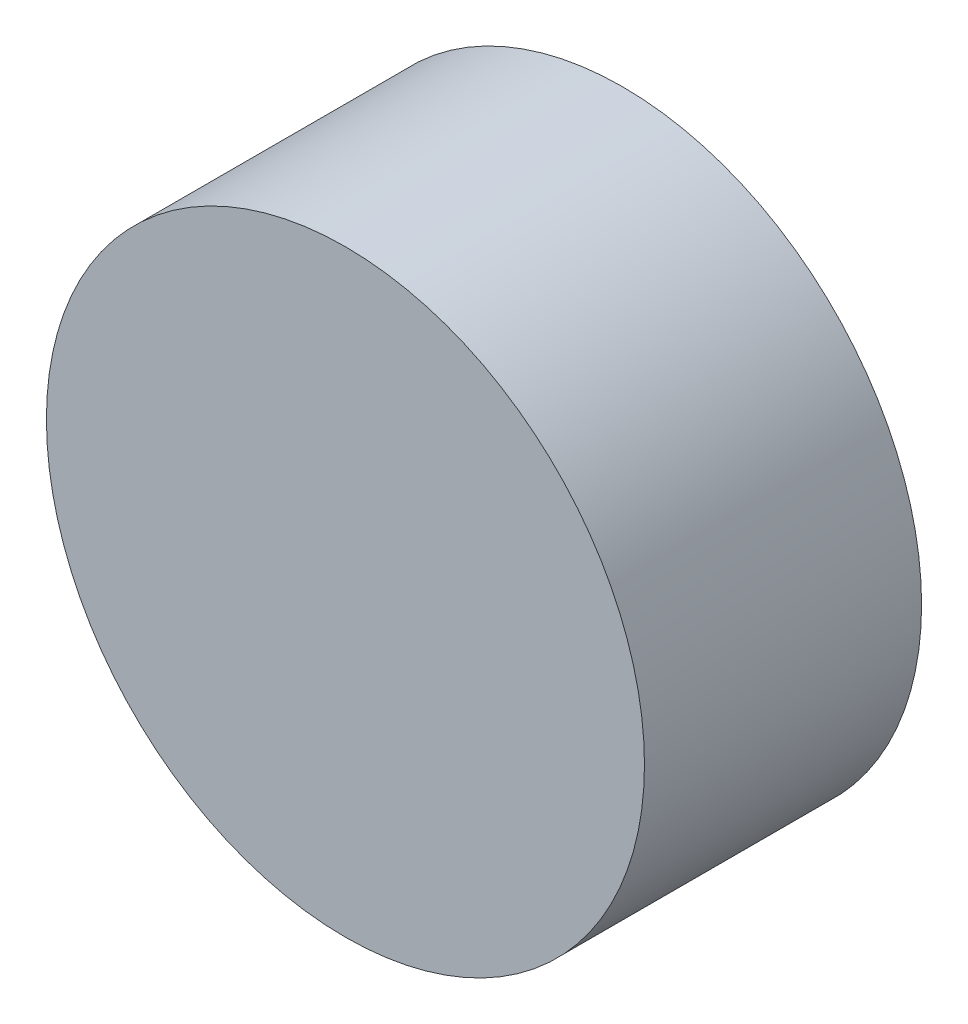
ISO-10303-21;
HEADER;
FILE_DESCRIPTION(('STEP AP214'),'2;1');
FILE_NAME('part.step','',(''),(''),'','','');
FILE_SCHEMA(('AUTOMOTIVE_DESIGN { 1 0 10303 214 1 1 1 1 }'));
ENDSEC;
DATA;
#1=APPLICATION_CONTEXT('core data for automotive mechanical design processes');
#2=APPLICATION_PROTOCOL_DEFINITION('international standard','automotive_design',2000,#1);
#3=PRODUCT_CONTEXT('',#1,'mechanical');
#4=PRODUCT('Part','Part','',(#3));
#5=PRODUCT_RELATED_PRODUCT_CATEGORY('part','',(#4));
#6=PRODUCT_DEFINITION_FORMATION('','',#4);
#7=PRODUCT_DEFINITION_CONTEXT('part definition',#1,'design');
#8=PRODUCT_DEFINITION('design','',#6,#7);
#9=PRODUCT_DEFINITION_SHAPE('','',#8);
#10=(LENGTH_UNIT() NAMED_UNIT(*) SI_UNIT(.MILLI.,.METRE.));
#11=(NAMED_UNIT(*) PLANE_ANGLE_UNIT() SI_UNIT($,.RADIAN.));
#12=(NAMED_UNIT(*) SI_UNIT($,.STERADIAN.) SOLID_ANGLE_UNIT());
#13=UNCERTAINTY_MEASURE_WITH_UNIT(LENGTH_MEASURE(1.E-05),#10,'distance_accuracy_value','');
#14=(GEOMETRIC_REPRESENTATION_CONTEXT(3) GLOBAL_UNCERTAINTY_ASSIGNED_CONTEXT((#13)) GLOBAL_UNIT_ASSIGNED_CONTEXT((#10,
#11,#12)) REPRESENTATION_CONTEXT('',''));
#15=CARTESIAN_POINT('',(0.,0.,0.));
#16=DIRECTION('',(0.,0.,1.));
#17=DIRECTION('',(1.,0.,0.));
#18=AXIS2_PLACEMENT_3D('',#15,#16,#17);
#19=CARTESIAN_POINT('',(28.,15.9999999999979,5.588));
#20=DIRECTION('',(0.,0.,-1.));
#21=DIRECTION('',(-1.,0.,0.));
#22=AXIS2_PLACEMENT_3D('',#19,#20,#21);
#23=PLANE('',#22);
#24=CARTESIAN_POINT('',(40.,16.,5.588));
#25=DIRECTION('',(0.,0.,1.));
#26=DIRECTION('',(1.,0.,0.));
#27=AXIS2_PLACEMENT_3D('',#24,#25,#26);
#28=CIRCLE('',#27,6.0298731);
#29=CARTESIAN_POINT('',(46.0298731,16.,5.588));
#30=VERTEX_POINT('',#29);
#31=EDGE_CURVE('E18',#30,#30,#28,.F.);
#32=ORIENTED_EDGE('',*,*,#31,.F.);
#33=EDGE_LOOP('',(#32));
#34=FACE_BOUND('',#33,.T.);
#35=ADVANCED_FACE('F15',(#34),#23,.F.);
#36=CARTESIAN_POINT('',(28.,15.9999999999979,0.));
#37=DIRECTION('',(0.,0.,-1.));
#38=DIRECTION('',(-1.,0.,0.));
#39=AXIS2_PLACEMENT_3D('',#36,#37,#38);
#40=PLANE('',#39);
#41=CARTESIAN_POINT('',(40.,16.,0.));
#42=DIRECTION('',(0.,0.,1.));
#43=DIRECTION('',(1.,0.,0.));
#44=AXIS2_PLACEMENT_3D('',#41,#42,#43);
#45=CIRCLE('',#44,6.0298731);
#46=CARTESIAN_POINT('',(46.0298731,16.,0.));
#47=VERTEX_POINT('',#46);
#48=EDGE_CURVE('E10',#47,#47,#45,.T.);
#49=ORIENTED_EDGE('',*,*,#48,.F.);
#50=EDGE_LOOP('',(#49));
#51=FACE_BOUND('',#50,.T.);
#52=ADVANCED_FACE('F30',(#51),#40,.T.);
#53=CARTESIAN_POINT('',(40.,16.,5.588));
#54=DIRECTION('',(0.,0.,1.));
#55=DIRECTION('',(1.,0.,0.));
#56=AXIS2_PLACEMENT_3D('',#53,#54,#55);
#57=CYLINDRICAL_SURFACE('',#56,6.0298731);
#58=ORIENTED_EDGE('',*,*,#48,.T.);
#59=EDGE_LOOP('',(#58));
#60=FACE_BOUND('',#59,.T.);
#61=ORIENTED_EDGE('',*,*,#31,.T.);
#62=EDGE_LOOP('',(#61));
#63=FACE_BOUND('',#62,.T.);
#64=ADVANCED_FACE('F27',(#60,#63),#57,.T.);
#65=CLOSED_SHELL('',(#35,#52,#64));
#66=MANIFOLD_SOLID_BREP('B1',#65);
#67=ADVANCED_BREP_SHAPE_REPRESENTATION('',(#18,#66),#14);
#68=SHAPE_DEFINITION_REPRESENTATION(#9,#67);
ENDSEC;
END-ISO-10303-21;
